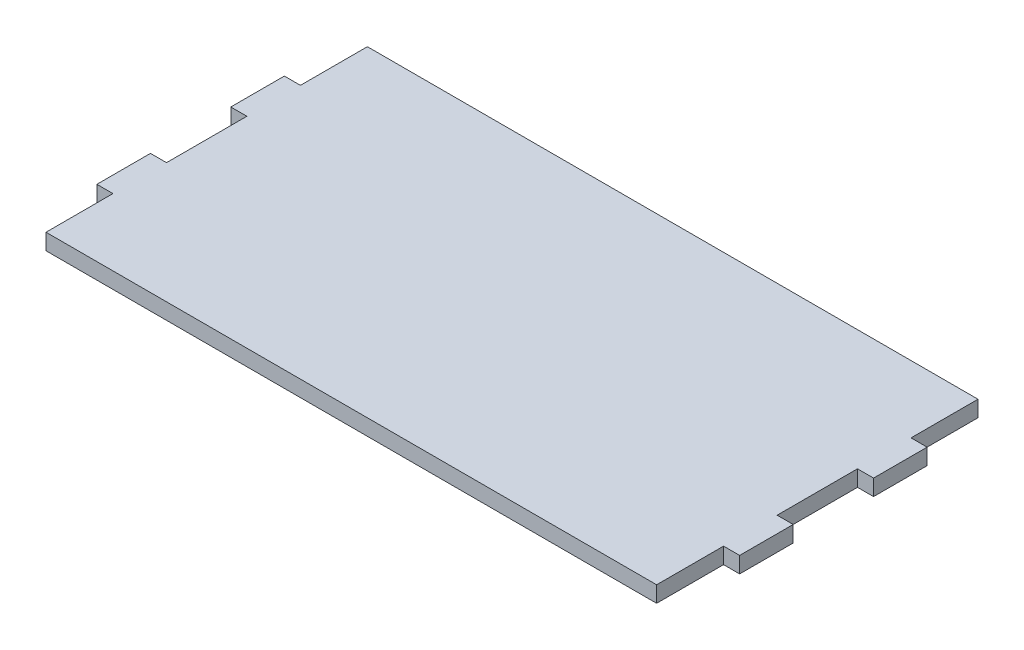
ISO-10303-21;
HEADER;
FILE_DESCRIPTION(('STEP AP214'),'2;1');
FILE_NAME('part.step','',(''),(''),'','','');
FILE_SCHEMA(('AUTOMOTIVE_DESIGN { 1 0 10303 214 1 1 1 1 }'));
ENDSEC;
DATA;
#1=APPLICATION_CONTEXT('core data for automotive mechanical design processes');
#2=APPLICATION_PROTOCOL_DEFINITION('international standard','automotive_design',2000,#1);
#3=PRODUCT_CONTEXT('',#1,'mechanical');
#4=PRODUCT('Part','Part','',(#3));
#5=PRODUCT_RELATED_PRODUCT_CATEGORY('part','',(#4));
#6=PRODUCT_DEFINITION_FORMATION('','',#4);
#7=PRODUCT_DEFINITION_CONTEXT('part definition',#1,'design');
#8=PRODUCT_DEFINITION('design','',#6,#7);
#9=PRODUCT_DEFINITION_SHAPE('','',#8);
#10=(LENGTH_UNIT() NAMED_UNIT(*) SI_UNIT(.MILLI.,.METRE.));
#11=(NAMED_UNIT(*) PLANE_ANGLE_UNIT() SI_UNIT($,.RADIAN.));
#12=(NAMED_UNIT(*) SI_UNIT($,.STERADIAN.) SOLID_ANGLE_UNIT());
#13=UNCERTAINTY_MEASURE_WITH_UNIT(LENGTH_MEASURE(1.E-05),#10,'distance_accuracy_value','');
#14=(GEOMETRIC_REPRESENTATION_CONTEXT(3) GLOBAL_UNCERTAINTY_ASSIGNED_CONTEXT((#13)) GLOBAL_UNIT_ASSIGNED_CONTEXT((#10,
#11,#12)) REPRESENTATION_CONTEXT('',''));
#15=CARTESIAN_POINT('',(0.,0.,0.));
#16=DIRECTION('',(0.,0.,1.));
#17=DIRECTION('',(1.,0.,0.));
#18=AXIS2_PLACEMENT_3D('',#15,#16,#17);
#19=CARTESIAN_POINT('',(-57.,3.,17.5));
#20=DIRECTION('',(1.,0.,0.));
#21=DIRECTION('',(0.,0.,-1.));
#22=AXIS2_PLACEMENT_3D('',#19,#20,#21);
#23=PLANE('',#22);
#24=DIRECTION('',(0.,0.,1.));
#25=VECTOR('',#24,1.);
#26=CARTESIAN_POINT('',(-57.,0.,17.5));
#27=LINE('',#26,#25);
#28=CARTESIAN_POINT('',(-57.,0.,17.5));
#29=VERTEX_POINT('',#28);
#30=CARTESIAN_POINT('',(-57.,0.,30.));
#31=VERTEX_POINT('',#30);
#32=EDGE_CURVE('E203',#29,#31,#27,.T.);
#33=ORIENTED_EDGE('',*,*,#32,.T.);
#34=DIRECTION('',(0.,-1.,0.));
#35=VECTOR('',#34,1.);
#36=CARTESIAN_POINT('',(-57.,3.,30.));
#37=LINE('',#36,#35);
#38=CARTESIAN_POINT('',(-57.,3.,30.));
#39=VERTEX_POINT('',#38);
#40=EDGE_CURVE('E11',#39,#31,#37,.T.);
#41=ORIENTED_EDGE('',*,*,#40,.F.);
#42=DIRECTION('',(0.,0.,1.));
#43=VECTOR('',#42,1.);
#44=CARTESIAN_POINT('',(-57.,3.,17.5));
#45=LINE('',#44,#43);
#46=CARTESIAN_POINT('',(-57.,3.,17.5));
#47=VERTEX_POINT('',#46);
#48=EDGE_CURVE('E241',#47,#39,#45,.T.);
#49=ORIENTED_EDGE('',*,*,#48,.F.);
#50=DIRECTION('',(0.,-1.,0.));
#51=VECTOR('',#50,1.);
#52=CARTESIAN_POINT('',(-57.,3.,17.5));
#53=LINE('',#52,#51);
#54=EDGE_CURVE('E199',#47,#29,#53,.T.);
#55=ORIENTED_EDGE('',*,*,#54,.T.);
#56=EDGE_LOOP('',(#33,#41,#49,#55));
#57=FACE_BOUND('',#56,.T.);
#58=ADVANCED_FACE('F35',(#57),#23,.F.);
#59=CARTESIAN_POINT('',(57.,3.,30.));
#60=DIRECTION('',(0.,0.,-1.));
#61=DIRECTION('',(-1.,0.,0.));
#62=AXIS2_PLACEMENT_3D('',#59,#60,#61);
#63=PLANE('',#62);
#64=DIRECTION('',(1.,0.,0.));
#65=VECTOR('',#64,1.);
#66=CARTESIAN_POINT('',(57.,0.,30.));
#67=LINE('',#66,#65);
#68=CARTESIAN_POINT('',(57.,0.,30.));
#69=VERTEX_POINT('',#68);
#70=EDGE_CURVE('E206',#31,#69,#67,.T.);
#71=ORIENTED_EDGE('',*,*,#70,.T.);
#72=DIRECTION('',(0.,-1.,0.));
#73=VECTOR('',#72,1.);
#74=CARTESIAN_POINT('',(57.,3.,30.));
#75=LINE('',#74,#73);
#76=CARTESIAN_POINT('',(57.,3.,30.));
#77=VERTEX_POINT('',#76);
#78=EDGE_CURVE('E43',#77,#69,#75,.T.);
#79=ORIENTED_EDGE('',*,*,#78,.F.);
#80=DIRECTION('',(1.,0.,0.));
#81=VECTOR('',#80,1.);
#82=CARTESIAN_POINT('',(57.,3.,30.));
#83=LINE('',#82,#81);
#84=EDGE_CURVE('E130',#39,#77,#83,.T.);
#85=ORIENTED_EDGE('',*,*,#84,.F.);
#86=ORIENTED_EDGE('',*,*,#40,.T.);
#87=EDGE_LOOP('',(#71,#79,#85,#86));
#88=FACE_BOUND('',#87,.T.);
#89=ADVANCED_FACE('F359',(#88),#63,.F.);
#90=CARTESIAN_POINT('',(57.,3.,17.5));
#91=DIRECTION('',(-1.,0.,0.));
#92=DIRECTION('',(0.,0.,1.));
#93=AXIS2_PLACEMENT_3D('',#90,#91,#92);
#94=PLANE('',#93);
#95=DIRECTION('',(0.,0.,-1.));
#96=VECTOR('',#95,1.);
#97=CARTESIAN_POINT('',(57.,0.,17.5));
#98=LINE('',#97,#96);
#99=CARTESIAN_POINT('',(57.,0.,17.5));
#100=VERTEX_POINT('',#99);
#101=EDGE_CURVE('E208',#69,#100,#98,.T.);
#102=ORIENTED_EDGE('',*,*,#101,.T.);
#103=DIRECTION('',(0.,-1.,0.));
#104=VECTOR('',#103,1.);
#105=CARTESIAN_POINT('',(57.,3.,17.5));
#106=LINE('',#105,#104);
#107=CARTESIAN_POINT('',(57.,3.,17.5));
#108=VERTEX_POINT('',#107);
#109=EDGE_CURVE('E284',#108,#100,#106,.T.);
#110=ORIENTED_EDGE('',*,*,#109,.F.);
#111=DIRECTION('',(0.,0.,-1.));
#112=VECTOR('',#111,1.);
#113=CARTESIAN_POINT('',(57.,3.,17.5));
#114=LINE('',#113,#112);
#115=EDGE_CURVE('E292',#77,#108,#114,.T.);
#116=ORIENTED_EDGE('',*,*,#115,.F.);
#117=ORIENTED_EDGE('',*,*,#78,.T.);
#118=EDGE_LOOP('',(#102,#110,#116,#117));
#119=FACE_BOUND('',#118,.T.);
#120=ADVANCED_FACE('F290',(#119),#94,.F.);
#121=CARTESIAN_POINT('',(60.,3.,17.5));
#122=DIRECTION('',(0.,0.,-1.));
#123=DIRECTION('',(-1.,0.,0.));
#124=AXIS2_PLACEMENT_3D('',#121,#122,#123);
#125=PLANE('',#124);
#126=DIRECTION('',(1.,0.,0.));
#127=VECTOR('',#126,1.);
#128=CARTESIAN_POINT('',(60.,0.,17.5));
#129=LINE('',#128,#127);
#130=CARTESIAN_POINT('',(60.,0.,17.5));
#131=VERTEX_POINT('',#130);
#132=EDGE_CURVE('E210',#100,#131,#129,.T.);
#133=ORIENTED_EDGE('',*,*,#132,.T.);
#134=DIRECTION('',(0.,-1.,0.));
#135=VECTOR('',#134,1.);
#136=CARTESIAN_POINT('',(60.,3.,17.5));
#137=LINE('',#136,#135);
#138=CARTESIAN_POINT('',(60.,3.,17.5));
#139=VERTEX_POINT('',#138);
#140=EDGE_CURVE('E281',#139,#131,#137,.T.);
#141=ORIENTED_EDGE('',*,*,#140,.F.);
#142=DIRECTION('',(1.,0.,0.));
#143=VECTOR('',#142,1.);
#144=CARTESIAN_POINT('',(60.,3.,17.5));
#145=LINE('',#144,#143);
#146=EDGE_CURVE('E310',#108,#139,#145,.T.);
#147=ORIENTED_EDGE('',*,*,#146,.F.);
#148=ORIENTED_EDGE('',*,*,#109,.T.);
#149=EDGE_LOOP('',(#133,#141,#147,#148));
#150=FACE_BOUND('',#149,.T.);
#151=ADVANCED_FACE('F301',(#150),#125,.F.);
#152=CARTESIAN_POINT('',(60.,3.,7.49999999999999));
#153=DIRECTION('',(-1.,0.,0.));
#154=DIRECTION('',(0.,0.,1.));
#155=AXIS2_PLACEMENT_3D('',#152,#153,#154);
#156=PLANE('',#155);
#157=DIRECTION('',(0.,0.,-1.));
#158=VECTOR('',#157,1.);
#159=CARTESIAN_POINT('',(60.,0.,7.49999999999999));
#160=LINE('',#159,#158);
#161=CARTESIAN_POINT('',(60.,0.,7.49999999999999));
#162=VERTEX_POINT('',#161);
#163=EDGE_CURVE('E212',#131,#162,#160,.T.);
#164=ORIENTED_EDGE('',*,*,#163,.T.);
#165=DIRECTION('',(0.,-1.,0.));
#166=VECTOR('',#165,1.);
#167=CARTESIAN_POINT('',(60.,3.,7.49999999999999));
#168=LINE('',#167,#166);
#169=CARTESIAN_POINT('',(60.,3.,7.49999999999999));
#170=VERTEX_POINT('',#169);
#171=EDGE_CURVE('E278',#170,#162,#168,.T.);
#172=ORIENTED_EDGE('',*,*,#171,.F.);
#173=DIRECTION('',(0.,0.,-1.));
#174=VECTOR('',#173,1.);
#175=CARTESIAN_POINT('',(60.,3.,7.49999999999999));
#176=LINE('',#175,#174);
#177=EDGE_CURVE('E307',#139,#170,#176,.T.);
#178=ORIENTED_EDGE('',*,*,#177,.F.);
#179=ORIENTED_EDGE('',*,*,#140,.T.);
#180=EDGE_LOOP('',(#164,#172,#178,#179));
#181=FACE_BOUND('',#180,.T.);
#182=ADVANCED_FACE('F305',(#181),#156,.F.);
#183=CARTESIAN_POINT('',(57.,3.,7.49999999999999));
#184=DIRECTION('',(0.,0.,1.));
#185=DIRECTION('',(1.,0.,0.));
#186=AXIS2_PLACEMENT_3D('',#183,#184,#185);
#187=PLANE('',#186);
#188=DIRECTION('',(-1.,0.,0.));
#189=VECTOR('',#188,1.);
#190=CARTESIAN_POINT('',(57.,0.,7.49999999999999));
#191=LINE('',#190,#189);
#192=CARTESIAN_POINT('',(57.,0.,7.49999999999999));
#193=VERTEX_POINT('',#192);
#194=EDGE_CURVE('E214',#162,#193,#191,.T.);
#195=ORIENTED_EDGE('',*,*,#194,.T.);
#196=DIRECTION('',(0.,-1.,0.));
#197=VECTOR('',#196,1.);
#198=CARTESIAN_POINT('',(57.,3.,7.49999999999999));
#199=LINE('',#198,#197);
#200=CARTESIAN_POINT('',(57.,3.,7.49999999999999));
#201=VERTEX_POINT('',#200);
#202=EDGE_CURVE('E275',#201,#193,#199,.T.);
#203=ORIENTED_EDGE('',*,*,#202,.F.);
#204=DIRECTION('',(-1.,0.,0.));
#205=VECTOR('',#204,1.);
#206=CARTESIAN_POINT('',(57.,3.,7.49999999999999));
#207=LINE('',#206,#205);
#208=EDGE_CURVE('E309',#170,#201,#207,.T.);
#209=ORIENTED_EDGE('',*,*,#208,.F.);
#210=ORIENTED_EDGE('',*,*,#171,.T.);
#211=EDGE_LOOP('',(#195,#203,#209,#210));
#212=FACE_BOUND('',#211,.T.);
#213=ADVANCED_FACE('F372',(#212),#187,.F.);
#214=CARTESIAN_POINT('',(57.,3.,-7.5));
#215=DIRECTION('',(-1.,0.,0.));
#216=DIRECTION('',(0.,0.,1.));
#217=AXIS2_PLACEMENT_3D('',#214,#215,#216);
#218=PLANE('',#217);
#219=DIRECTION('',(0.,0.,-1.));
#220=VECTOR('',#219,1.);
#221=CARTESIAN_POINT('',(57.,0.,-7.5));
#222=LINE('',#221,#220);
#223=CARTESIAN_POINT('',(57.,0.,-7.5));
#224=VERTEX_POINT('',#223);
#225=EDGE_CURVE('E216',#193,#224,#222,.T.);
#226=ORIENTED_EDGE('',*,*,#225,.T.);
#227=DIRECTION('',(0.,-1.,0.));
#228=VECTOR('',#227,1.);
#229=CARTESIAN_POINT('',(57.,3.,-7.5));
#230=LINE('',#229,#228);
#231=CARTESIAN_POINT('',(57.,3.,-7.5));
#232=VERTEX_POINT('',#231);
#233=EDGE_CURVE('E272',#232,#224,#230,.T.);
#234=ORIENTED_EDGE('',*,*,#233,.F.);
#235=DIRECTION('',(0.,0.,-1.));
#236=VECTOR('',#235,1.);
#237=CARTESIAN_POINT('',(57.,3.,-7.5));
#238=LINE('',#237,#236);
#239=EDGE_CURVE('E312',#201,#232,#238,.T.);
#240=ORIENTED_EDGE('',*,*,#239,.F.);
#241=ORIENTED_EDGE('',*,*,#202,.T.);
#242=EDGE_LOOP('',(#226,#234,#240,#241));
#243=FACE_BOUND('',#242,.T.);
#244=ADVANCED_FACE('F375',(#243),#218,.F.);
#245=CARTESIAN_POINT('',(60.,3.,-7.5));
#246=DIRECTION('',(0.,0.,-1.));
#247=DIRECTION('',(-1.,0.,0.));
#248=AXIS2_PLACEMENT_3D('',#245,#246,#247);
#249=PLANE('',#248);
#250=DIRECTION('',(1.,0.,0.));
#251=VECTOR('',#250,1.);
#252=CARTESIAN_POINT('',(60.,0.,-7.5));
#253=LINE('',#252,#251);
#254=CARTESIAN_POINT('',(60.,0.,-7.5));
#255=VERTEX_POINT('',#254);
#256=EDGE_CURVE('E218',#224,#255,#253,.T.);
#257=ORIENTED_EDGE('',*,*,#256,.T.);
#258=DIRECTION('',(0.,-1.,0.));
#259=VECTOR('',#258,1.);
#260=CARTESIAN_POINT('',(60.,3.,-7.5));
#261=LINE('',#260,#259);
#262=CARTESIAN_POINT('',(60.,3.,-7.5));
#263=VERTEX_POINT('',#262);
#264=EDGE_CURVE('E269',#263,#255,#261,.T.);
#265=ORIENTED_EDGE('',*,*,#264,.F.);
#266=DIRECTION('',(1.,0.,0.));
#267=VECTOR('',#266,1.);
#268=CARTESIAN_POINT('',(60.,3.,-7.5));
#269=LINE('',#268,#267);
#270=EDGE_CURVE('E318',#232,#263,#269,.T.);
#271=ORIENTED_EDGE('',*,*,#270,.F.);
#272=ORIENTED_EDGE('',*,*,#233,.T.);
#273=EDGE_LOOP('',(#257,#265,#271,#272));
#274=FACE_BOUND('',#273,.T.);
#275=ADVANCED_FACE('F379',(#274),#249,.F.);
#276=CARTESIAN_POINT('',(60.,3.,-17.5));
#277=DIRECTION('',(-1.,0.,0.));
#278=DIRECTION('',(0.,0.,1.));
#279=AXIS2_PLACEMENT_3D('',#276,#277,#278);
#280=PLANE('',#279);
#281=DIRECTION('',(0.,0.,-1.));
#282=VECTOR('',#281,1.);
#283=CARTESIAN_POINT('',(60.,0.,-17.5));
#284=LINE('',#283,#282);
#285=CARTESIAN_POINT('',(60.,0.,-17.5));
#286=VERTEX_POINT('',#285);
#287=EDGE_CURVE('E220',#255,#286,#284,.T.);
#288=ORIENTED_EDGE('',*,*,#287,.T.);
#289=DIRECTION('',(0.,-1.,0.));
#290=VECTOR('',#289,1.);
#291=CARTESIAN_POINT('',(60.,3.,-17.5));
#292=LINE('',#291,#290);
#293=CARTESIAN_POINT('',(60.,3.,-17.5));
#294=VERTEX_POINT('',#293);
#295=EDGE_CURVE('E266',#294,#286,#292,.T.);
#296=ORIENTED_EDGE('',*,*,#295,.F.);
#297=DIRECTION('',(0.,0.,-1.));
#298=VECTOR('',#297,1.);
#299=CARTESIAN_POINT('',(60.,3.,-17.5));
#300=LINE('',#299,#298);
#301=EDGE_CURVE('E320',#263,#294,#300,.T.);
#302=ORIENTED_EDGE('',*,*,#301,.F.);
#303=ORIENTED_EDGE('',*,*,#264,.T.);
#304=EDGE_LOOP('',(#288,#296,#302,#303));
#305=FACE_BOUND('',#304,.T.);
#306=ADVANCED_FACE('F383',(#305),#280,.F.);
#307=CARTESIAN_POINT('',(57.,3.,-17.5));
#308=DIRECTION('',(0.,0.,1.));
#309=DIRECTION('',(1.,0.,0.));
#310=AXIS2_PLACEMENT_3D('',#307,#308,#309);
#311=PLANE('',#310);
#312=DIRECTION('',(-1.,0.,0.));
#313=VECTOR('',#312,1.);
#314=CARTESIAN_POINT('',(57.,0.,-17.5));
#315=LINE('',#314,#313);
#316=CARTESIAN_POINT('',(57.,0.,-17.5));
#317=VERTEX_POINT('',#316);
#318=EDGE_CURVE('E222',#286,#317,#315,.T.);
#319=ORIENTED_EDGE('',*,*,#318,.T.);
#320=DIRECTION('',(0.,-1.,0.));
#321=VECTOR('',#320,1.);
#322=CARTESIAN_POINT('',(57.,3.,-17.5));
#323=LINE('',#322,#321);
#324=CARTESIAN_POINT('',(57.,3.,-17.5));
#325=VERTEX_POINT('',#324);
#326=EDGE_CURVE('E263',#325,#317,#323,.T.);
#327=ORIENTED_EDGE('',*,*,#326,.F.);
#328=DIRECTION('',(-1.,0.,0.));
#329=VECTOR('',#328,1.);
#330=CARTESIAN_POINT('',(57.,3.,-17.5));
#331=LINE('',#330,#329);
#332=EDGE_CURVE('E322',#294,#325,#331,.T.);
#333=ORIENTED_EDGE('',*,*,#332,.F.);
#334=ORIENTED_EDGE('',*,*,#295,.T.);
#335=EDGE_LOOP('',(#319,#327,#333,#334));
#336=FACE_BOUND('',#335,.T.);
#337=ADVANCED_FACE('F387',(#336),#311,.F.);
#338=CARTESIAN_POINT('',(57.,3.,-30.));
#339=DIRECTION('',(-1.,0.,0.));
#340=DIRECTION('',(0.,0.,1.));
#341=AXIS2_PLACEMENT_3D('',#338,#339,#340);
#342=PLANE('',#341);
#343=DIRECTION('',(0.,0.,-1.));
#344=VECTOR('',#343,1.);
#345=CARTESIAN_POINT('',(57.,0.,-30.));
#346=LINE('',#345,#344);
#347=CARTESIAN_POINT('',(57.,0.,-30.));
#348=VERTEX_POINT('',#347);
#349=EDGE_CURVE('E224',#317,#348,#346,.T.);
#350=ORIENTED_EDGE('',*,*,#349,.T.);
#351=DIRECTION('',(0.,-1.,0.));
#352=VECTOR('',#351,1.);
#353=CARTESIAN_POINT('',(57.,3.,-30.));
#354=LINE('',#353,#352);
#355=CARTESIAN_POINT('',(57.,3.,-30.));
#356=VERTEX_POINT('',#355);
#357=EDGE_CURVE('E260',#356,#348,#354,.T.);
#358=ORIENTED_EDGE('',*,*,#357,.F.);
#359=DIRECTION('',(0.,0.,-1.));
#360=VECTOR('',#359,1.);
#361=CARTESIAN_POINT('',(57.,3.,-30.));
#362=LINE('',#361,#360);
#363=EDGE_CURVE('E324',#325,#356,#362,.T.);
#364=ORIENTED_EDGE('',*,*,#363,.F.);
#365=ORIENTED_EDGE('',*,*,#326,.T.);
#366=EDGE_LOOP('',(#350,#358,#364,#365));
#367=FACE_BOUND('',#366,.T.);
#368=ADVANCED_FACE('F391',(#367),#342,.F.);
#369=CARTESIAN_POINT('',(57.,3.,-30.));
#370=DIRECTION('',(0.,0.,1.));
#371=DIRECTION('',(1.,0.,0.));
#372=AXIS2_PLACEMENT_3D('',#369,#370,#371);
#373=PLANE('',#372);
#374=DIRECTION('',(-1.,0.,0.));
#375=VECTOR('',#374,1.);
#376=CARTESIAN_POINT('',(57.,0.,-30.));
#377=LINE('',#376,#375);
#378=CARTESIAN_POINT('',(-57.,0.,-30.));
#379=VERTEX_POINT('',#378);
#380=EDGE_CURVE('E226',#348,#379,#377,.T.);
#381=ORIENTED_EDGE('',*,*,#380,.T.);
#382=DIRECTION('',(0.,-1.,0.));
#383=VECTOR('',#382,1.);
#384=CARTESIAN_POINT('',(-57.,3.,-30.));
#385=LINE('',#384,#383);
#386=CARTESIAN_POINT('',(-57.,3.,-30.));
#387=VERTEX_POINT('',#386);
#388=EDGE_CURVE('E257',#387,#379,#385,.T.);
#389=ORIENTED_EDGE('',*,*,#388,.F.);
#390=DIRECTION('',(-1.,0.,0.));
#391=VECTOR('',#390,1.);
#392=CARTESIAN_POINT('',(57.,3.,-30.));
#393=LINE('',#392,#391);
#394=EDGE_CURVE('E326',#356,#387,#393,.T.);
#395=ORIENTED_EDGE('',*,*,#394,.F.);
#396=ORIENTED_EDGE('',*,*,#357,.T.);
#397=EDGE_LOOP('',(#381,#389,#395,#396));
#398=FACE_BOUND('',#397,.T.);
#399=ADVANCED_FACE('F395',(#398),#373,.F.);
#400=CARTESIAN_POINT('',(-57.,3.,-30.));
#401=DIRECTION('',(1.,0.,0.));
#402=DIRECTION('',(0.,0.,-1.));
#403=AXIS2_PLACEMENT_3D('',#400,#401,#402);
#404=PLANE('',#403);
#405=DIRECTION('',(0.,0.,1.));
#406=VECTOR('',#405,1.);
#407=CARTESIAN_POINT('',(-57.,0.,-30.));
#408=LINE('',#407,#406);
#409=CARTESIAN_POINT('',(-57.,0.,-17.5));
#410=VERTEX_POINT('',#409);
#411=EDGE_CURVE('E228',#379,#410,#408,.T.);
#412=ORIENTED_EDGE('',*,*,#411,.T.);
#413=DIRECTION('',(0.,-1.,0.));
#414=VECTOR('',#413,1.);
#415=CARTESIAN_POINT('',(-57.,3.,-17.5));
#416=LINE('',#415,#414);
#417=CARTESIAN_POINT('',(-57.,3.,-17.5));
#418=VERTEX_POINT('',#417);
#419=EDGE_CURVE('E254',#418,#410,#416,.T.);
#420=ORIENTED_EDGE('',*,*,#419,.F.);
#421=DIRECTION('',(0.,0.,1.));
#422=VECTOR('',#421,1.);
#423=CARTESIAN_POINT('',(-57.,3.,-30.));
#424=LINE('',#423,#422);
#425=EDGE_CURVE('E328',#387,#418,#424,.T.);
#426=ORIENTED_EDGE('',*,*,#425,.F.);
#427=ORIENTED_EDGE('',*,*,#388,.T.);
#428=EDGE_LOOP('',(#412,#420,#426,#427));
#429=FACE_BOUND('',#428,.T.);
#430=ADVANCED_FACE('F399',(#429),#404,.F.);
#431=CARTESIAN_POINT('',(-57.,3.,-17.5));
#432=DIRECTION('',(0.,0.,1.));
#433=DIRECTION('',(1.,0.,0.));
#434=AXIS2_PLACEMENT_3D('',#431,#432,#433);
#435=PLANE('',#434);
#436=DIRECTION('',(-1.,0.,0.));
#437=VECTOR('',#436,1.);
#438=CARTESIAN_POINT('',(-57.,0.,-17.5));
#439=LINE('',#438,#437);
#440=CARTESIAN_POINT('',(-60.,0.,-17.5));
#441=VERTEX_POINT('',#440);
#442=EDGE_CURVE('E230',#410,#441,#439,.T.);
#443=ORIENTED_EDGE('',*,*,#442,.T.);
#444=DIRECTION('',(0.,-1.,0.));
#445=VECTOR('',#444,1.);
#446=CARTESIAN_POINT('',(-60.,3.,-17.5));
#447=LINE('',#446,#445);
#448=CARTESIAN_POINT('',(-60.,3.,-17.5));
#449=VERTEX_POINT('',#448);
#450=EDGE_CURVE('E251',#449,#441,#447,.T.);
#451=ORIENTED_EDGE('',*,*,#450,.F.);
#452=DIRECTION('',(-1.,0.,0.));
#453=VECTOR('',#452,1.);
#454=CARTESIAN_POINT('',(-57.,3.,-17.5));
#455=LINE('',#454,#453);
#456=EDGE_CURVE('E330',#418,#449,#455,.T.);
#457=ORIENTED_EDGE('',*,*,#456,.F.);
#458=ORIENTED_EDGE('',*,*,#419,.T.);
#459=EDGE_LOOP('',(#443,#451,#457,#458));
#460=FACE_BOUND('',#459,.T.);
#461=ADVANCED_FACE('F403',(#460),#435,.F.);
#462=CARTESIAN_POINT('',(-60.,3.,-17.5));
#463=DIRECTION('',(1.,0.,0.));
#464=DIRECTION('',(0.,0.,-1.));
#465=AXIS2_PLACEMENT_3D('',#462,#463,#464);
#466=PLANE('',#465);
#467=DIRECTION('',(0.,0.,1.));
#468=VECTOR('',#467,1.);
#469=CARTESIAN_POINT('',(-60.,0.,-17.5));
#470=LINE('',#469,#468);
#471=CARTESIAN_POINT('',(-60.,0.,-7.49999999999999));
#472=VERTEX_POINT('',#471);
#473=EDGE_CURVE('E232',#441,#472,#470,.T.);
#474=ORIENTED_EDGE('',*,*,#473,.T.);
#475=DIRECTION('',(0.,-1.,0.));
#476=VECTOR('',#475,1.);
#477=CARTESIAN_POINT('',(-60.,3.,-7.49999999999999));
#478=LINE('',#477,#476);
#479=CARTESIAN_POINT('',(-60.,3.,-7.49999999999999));
#480=VERTEX_POINT('',#479);
#481=EDGE_CURVE('E248',#480,#472,#478,.T.);
#482=ORIENTED_EDGE('',*,*,#481,.F.);
#483=DIRECTION('',(0.,0.,1.));
#484=VECTOR('',#483,1.);
#485=CARTESIAN_POINT('',(-60.,3.,-17.5));
#486=LINE('',#485,#484);
#487=EDGE_CURVE('E332',#449,#480,#486,.T.);
#488=ORIENTED_EDGE('',*,*,#487,.F.);
#489=ORIENTED_EDGE('',*,*,#450,.T.);
#490=EDGE_LOOP('',(#474,#482,#488,#489));
#491=FACE_BOUND('',#490,.T.);
#492=ADVANCED_FACE('F407',(#491),#466,.F.);
#493=CARTESIAN_POINT('',(-60.,3.,-7.49999999999999));
#494=DIRECTION('',(0.,0.,-1.));
#495=DIRECTION('',(-1.,0.,0.));
#496=AXIS2_PLACEMENT_3D('',#493,#494,#495);
#497=PLANE('',#496);
#498=DIRECTION('',(1.,0.,0.));
#499=VECTOR('',#498,1.);
#500=CARTESIAN_POINT('',(-60.,0.,-7.49999999999999));
#501=LINE('',#500,#499);
#502=CARTESIAN_POINT('',(-57.,0.,-7.49999999999999));
#503=VERTEX_POINT('',#502);
#504=EDGE_CURVE('E234',#472,#503,#501,.T.);
#505=ORIENTED_EDGE('',*,*,#504,.T.);
#506=DIRECTION('',(0.,-1.,0.));
#507=VECTOR('',#506,1.);
#508=CARTESIAN_POINT('',(-57.,3.,-7.49999999999999));
#509=LINE('',#508,#507);
#510=CARTESIAN_POINT('',(-57.,3.,-7.49999999999999));
#511=VERTEX_POINT('',#510);
#512=EDGE_CURVE('E245',#511,#503,#509,.T.);
#513=ORIENTED_EDGE('',*,*,#512,.F.);
#514=DIRECTION('',(1.,0.,0.));
#515=VECTOR('',#514,1.);
#516=CARTESIAN_POINT('',(-60.,3.,-7.49999999999999));
#517=LINE('',#516,#515);
#518=EDGE_CURVE('E334',#480,#511,#517,.T.);
#519=ORIENTED_EDGE('',*,*,#518,.F.);
#520=ORIENTED_EDGE('',*,*,#481,.T.);
#521=EDGE_LOOP('',(#505,#513,#519,#520));
#522=FACE_BOUND('',#521,.T.);
#523=ADVANCED_FACE('F340',(#522),#497,.F.);
#524=CARTESIAN_POINT('',(-57.,3.,-7.49999999999999));
#525=DIRECTION('',(1.,0.,0.));
#526=DIRECTION('',(0.,0.,-1.));
#527=AXIS2_PLACEMENT_3D('',#524,#525,#526);
#528=PLANE('',#527);
#529=DIRECTION('',(0.,0.,1.));
#530=VECTOR('',#529,1.);
#531=CARTESIAN_POINT('',(-57.,0.,-7.49999999999999));
#532=LINE('',#531,#530);
#533=CARTESIAN_POINT('',(-57.,0.,7.5));
#534=VERTEX_POINT('',#533);
#535=EDGE_CURVE('E236',#503,#534,#532,.T.);
#536=ORIENTED_EDGE('',*,*,#535,.T.);
#537=DIRECTION('',(0.,-1.,0.));
#538=VECTOR('',#537,1.);
#539=CARTESIAN_POINT('',(-57.,3.,7.5));
#540=LINE('',#539,#538);
#541=CARTESIAN_POINT('',(-57.,3.,7.5));
#542=VERTEX_POINT('',#541);
#543=EDGE_CURVE('E194',#542,#534,#540,.T.);
#544=ORIENTED_EDGE('',*,*,#543,.F.);
#545=DIRECTION('',(0.,0.,1.));
#546=VECTOR('',#545,1.);
#547=CARTESIAN_POINT('',(-57.,3.,-7.49999999999999));
#548=LINE('',#547,#546);
#549=EDGE_CURVE('E185',#511,#542,#548,.T.);
#550=ORIENTED_EDGE('',*,*,#549,.F.);
#551=ORIENTED_EDGE('',*,*,#512,.T.);
#552=EDGE_LOOP('',(#536,#544,#550,#551));
#553=FACE_BOUND('',#552,.T.);
#554=ADVANCED_FACE('F344',(#553),#528,.F.);
#555=CARTESIAN_POINT('',(-57.,3.,7.5));
#556=DIRECTION('',(0.,0.,1.));
#557=DIRECTION('',(1.,0.,0.));
#558=AXIS2_PLACEMENT_3D('',#555,#556,#557);
#559=PLANE('',#558);
#560=DIRECTION('',(-1.,0.,0.));
#561=VECTOR('',#560,1.);
#562=CARTESIAN_POINT('',(-57.,0.,7.5));
#563=LINE('',#562,#561);
#564=CARTESIAN_POINT('',(-60.,0.,7.5));
#565=VERTEX_POINT('',#564);
#566=EDGE_CURVE('E193',#534,#565,#563,.T.);
#567=ORIENTED_EDGE('',*,*,#566,.T.);
#568=DIRECTION('',(0.,-1.,0.));
#569=VECTOR('',#568,1.);
#570=CARTESIAN_POINT('',(-60.,3.,7.5));
#571=LINE('',#570,#569);
#572=CARTESIAN_POINT('',(-60.,3.,7.5));
#573=VERTEX_POINT('',#572);
#574=EDGE_CURVE('E190',#573,#565,#571,.T.);
#575=ORIENTED_EDGE('',*,*,#574,.F.);
#576=DIRECTION('',(-1.,0.,0.));
#577=VECTOR('',#576,1.);
#578=CARTESIAN_POINT('',(-57.,3.,7.5));
#579=LINE('',#578,#577);
#580=EDGE_CURVE('E179',#542,#573,#579,.T.);
#581=ORIENTED_EDGE('',*,*,#580,.F.);
#582=ORIENTED_EDGE('',*,*,#543,.T.);
#583=EDGE_LOOP('',(#567,#575,#581,#582));
#584=FACE_BOUND('',#583,.T.);
#585=ADVANCED_FACE('F191',(#584),#559,.F.);
#586=CARTESIAN_POINT('',(-60.,3.,7.5));
#587=DIRECTION('',(1.,0.,0.));
#588=DIRECTION('',(0.,0.,-1.));
#589=AXIS2_PLACEMENT_3D('',#586,#587,#588);
#590=PLANE('',#589);
#591=DIRECTION('',(0.,0.,1.));
#592=VECTOR('',#591,1.);
#593=CARTESIAN_POINT('',(-60.,0.,7.5));
#594=LINE('',#593,#592);
#595=CARTESIAN_POINT('',(-60.,0.,17.5));
#596=VERTEX_POINT('',#595);
#597=EDGE_CURVE('E116',#565,#596,#594,.T.);
#598=ORIENTED_EDGE('',*,*,#597,.T.);
#599=DIRECTION('',(0.,-1.,0.));
#600=VECTOR('',#599,1.);
#601=CARTESIAN_POINT('',(-60.,3.,17.5));
#602=LINE('',#601,#600);
#603=CARTESIAN_POINT('',(-60.,3.,17.5));
#604=VERTEX_POINT('',#603);
#605=EDGE_CURVE('E195',#604,#596,#602,.T.);
#606=ORIENTED_EDGE('',*,*,#605,.F.);
#607=DIRECTION('',(0.,0.,1.));
#608=VECTOR('',#607,1.);
#609=CARTESIAN_POINT('',(-60.,3.,7.5));
#610=LINE('',#609,#608);
#611=EDGE_CURVE('E183',#573,#604,#610,.T.);
#612=ORIENTED_EDGE('',*,*,#611,.F.);
#613=ORIENTED_EDGE('',*,*,#574,.T.);
#614=EDGE_LOOP('',(#598,#606,#612,#613));
#615=FACE_BOUND('',#614,.T.);
#616=ADVANCED_FACE('F197',(#615),#590,.F.);
#617=CARTESIAN_POINT('',(-60.,3.,17.5));
#618=DIRECTION('',(0.,0.,-1.));
#619=DIRECTION('',(-1.,0.,0.));
#620=AXIS2_PLACEMENT_3D('',#617,#618,#619);
#621=PLANE('',#620);
#622=DIRECTION('',(1.,0.,0.));
#623=VECTOR('',#622,1.);
#624=CARTESIAN_POINT('',(-60.,0.,17.5));
#625=LINE('',#624,#623);
#626=EDGE_CURVE('E122',#596,#29,#625,.T.);
#627=ORIENTED_EDGE('',*,*,#626,.T.);
#628=ORIENTED_EDGE('',*,*,#54,.F.);
#629=DIRECTION('',(1.,0.,0.));
#630=VECTOR('',#629,1.);
#631=CARTESIAN_POINT('',(-60.,3.,17.5));
#632=LINE('',#631,#630);
#633=EDGE_CURVE('E51',#604,#47,#632,.T.);
#634=ORIENTED_EDGE('',*,*,#633,.F.);
#635=ORIENTED_EDGE('',*,*,#605,.T.);
#636=EDGE_LOOP('',(#627,#628,#634,#635));
#637=FACE_BOUND('',#636,.T.);
#638=ADVANCED_FACE('F348',(#637),#621,.F.);
#639=CARTESIAN_POINT('',(0.,3.,0.));
#640=DIRECTION('',(0.,-1.,0.));
#641=DIRECTION('',(0.,0.,-1.));
#642=AXIS2_PLACEMENT_3D('',#639,#640,#641);
#643=PLANE('',#642);
#644=ORIENTED_EDGE('',*,*,#48,.T.);
#645=ORIENTED_EDGE('',*,*,#84,.T.);
#646=ORIENTED_EDGE('',*,*,#115,.T.);
#647=ORIENTED_EDGE('',*,*,#146,.T.);
#648=ORIENTED_EDGE('',*,*,#177,.T.);
#649=ORIENTED_EDGE('',*,*,#208,.T.);
#650=ORIENTED_EDGE('',*,*,#239,.T.);
#651=ORIENTED_EDGE('',*,*,#270,.T.);
#652=ORIENTED_EDGE('',*,*,#301,.T.);
#653=ORIENTED_EDGE('',*,*,#332,.T.);
#654=ORIENTED_EDGE('',*,*,#363,.T.);
#655=ORIENTED_EDGE('',*,*,#394,.T.);
#656=ORIENTED_EDGE('',*,*,#425,.T.);
#657=ORIENTED_EDGE('',*,*,#456,.T.);
#658=ORIENTED_EDGE('',*,*,#487,.T.);
#659=ORIENTED_EDGE('',*,*,#518,.T.);
#660=ORIENTED_EDGE('',*,*,#549,.T.);
#661=ORIENTED_EDGE('',*,*,#580,.T.);
#662=ORIENTED_EDGE('',*,*,#611,.T.);
#663=ORIENTED_EDGE('',*,*,#633,.T.);
#664=EDGE_LOOP('',(#644,#645,#646,#647,#648,#649,#650,#651,#652,#653,#654,#655,#656,#657,#658,
#659,#660,#661,#662,#663));
#665=FACE_BOUND('',#664,.T.);
#666=ADVANCED_FACE('F181',(#665),#643,.F.);
#667=CARTESIAN_POINT('',(0.,0.,0.));
#668=DIRECTION('',(0.,-1.,0.));
#669=DIRECTION('',(0.,0.,-1.));
#670=AXIS2_PLACEMENT_3D('',#667,#668,#669);
#671=PLANE('',#670);
#672=ORIENTED_EDGE('',*,*,#32,.F.);
#673=ORIENTED_EDGE('',*,*,#626,.F.);
#674=ORIENTED_EDGE('',*,*,#597,.F.);
#675=ORIENTED_EDGE('',*,*,#566,.F.);
#676=ORIENTED_EDGE('',*,*,#535,.F.);
#677=ORIENTED_EDGE('',*,*,#504,.F.);
#678=ORIENTED_EDGE('',*,*,#473,.F.);
#679=ORIENTED_EDGE('',*,*,#442,.F.);
#680=ORIENTED_EDGE('',*,*,#411,.F.);
#681=ORIENTED_EDGE('',*,*,#380,.F.);
#682=ORIENTED_EDGE('',*,*,#349,.F.);
#683=ORIENTED_EDGE('',*,*,#318,.F.);
#684=ORIENTED_EDGE('',*,*,#287,.F.);
#685=ORIENTED_EDGE('',*,*,#256,.F.);
#686=ORIENTED_EDGE('',*,*,#225,.F.);
#687=ORIENTED_EDGE('',*,*,#194,.F.);
#688=ORIENTED_EDGE('',*,*,#163,.F.);
#689=ORIENTED_EDGE('',*,*,#132,.F.);
#690=ORIENTED_EDGE('',*,*,#101,.F.);
#691=ORIENTED_EDGE('',*,*,#70,.F.);
#692=EDGE_LOOP('',(#672,#673,#674,#675,#676,#677,#678,#679,#680,#681,#682,#683,#684,#685,#686,
#687,#688,#689,#690,#691));
#693=FACE_BOUND('',#692,.T.);
#694=ADVANCED_FACE('F296',(#693),#671,.T.);
#695=CLOSED_SHELL('',(#58,#89,#120,#151,#182,#213,#244,#275,#306,#337,#368,#399,#430,#461,#492,
#523,#554,#585,#616,#638,#666,#694));
#696=MANIFOLD_SOLID_BREP('B2',#695);
#697=ADVANCED_BREP_SHAPE_REPRESENTATION('',(#18,#696),#14);
#698=SHAPE_DEFINITION_REPRESENTATION(#9,#697);
ENDSEC;
END-ISO-10303-21;
